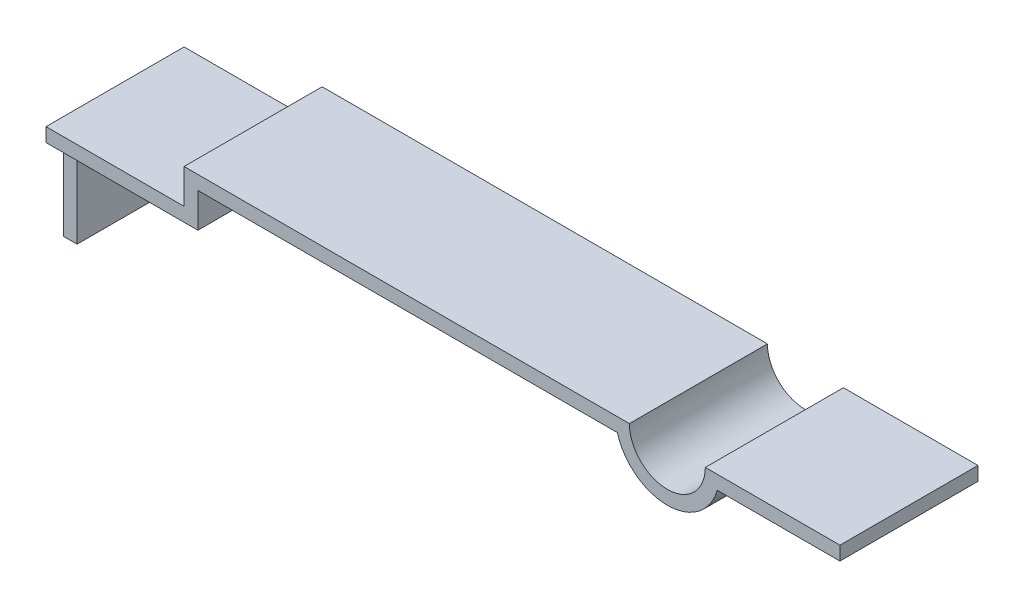
ISO-10303-21;
HEADER;
FILE_DESCRIPTION(('STEP AP214'),'2;1');
FILE_NAME('part.step','',(''),(''),'','','');
FILE_SCHEMA(('AUTOMOTIVE_DESIGN { 1 0 10303 214 1 1 1 1 }'));
ENDSEC;
DATA;
#1=APPLICATION_CONTEXT('core data for automotive mechanical design processes');
#2=APPLICATION_PROTOCOL_DEFINITION('international standard','automotive_design',2000,#1);
#3=PRODUCT_CONTEXT('',#1,'mechanical');
#4=PRODUCT('Part','Part','',(#3));
#5=PRODUCT_RELATED_PRODUCT_CATEGORY('part','',(#4));
#6=PRODUCT_DEFINITION_FORMATION('','',#4);
#7=PRODUCT_DEFINITION_CONTEXT('part definition',#1,'design');
#8=PRODUCT_DEFINITION('design','',#6,#7);
#9=PRODUCT_DEFINITION_SHAPE('','',#8);
#10=(LENGTH_UNIT() NAMED_UNIT(*) SI_UNIT(.MILLI.,.METRE.));
#11=(NAMED_UNIT(*) PLANE_ANGLE_UNIT() SI_UNIT($,.RADIAN.));
#12=(NAMED_UNIT(*) SI_UNIT($,.STERADIAN.) SOLID_ANGLE_UNIT());
#13=UNCERTAINTY_MEASURE_WITH_UNIT(LENGTH_MEASURE(1.E-05),#10,'distance_accuracy_value','');
#14=(GEOMETRIC_REPRESENTATION_CONTEXT(3) GLOBAL_UNCERTAINTY_ASSIGNED_CONTEXT((#13)) GLOBAL_UNIT_ASSIGNED_CONTEXT((#10,
#11,#12)) REPRESENTATION_CONTEXT('',''));
#15=CARTESIAN_POINT('',(0.,0.,0.));
#16=DIRECTION('',(0.,0.,1.));
#17=DIRECTION('',(1.,0.,0.));
#18=AXIS2_PLACEMENT_3D('',#15,#16,#17);
#19=CARTESIAN_POINT('',(0.,0.3,2.));
#20=DIRECTION('',(0.,1.,0.));
#21=DIRECTION('',(-1.,0.,0.));
#22=AXIS2_PLACEMENT_3D('',#19,#20,#21);
#23=PLANE('',#22);
#24=DIRECTION('',(1.,0.,0.));
#25=VECTOR('',#24,1.);
#26=CARTESIAN_POINT('',(0.,0.3,0.));
#27=LINE('',#26,#25);
#28=CARTESIAN_POINT('',(0.2,0.299999999999999,0.));
#29=VERTEX_POINT('',#28);
#30=CARTESIAN_POINT('',(6.27715838525995,0.299999999999978,0.));
#31=VERTEX_POINT('',#30);
#32=EDGE_CURVE('E168',#29,#31,#27,.T.);
#33=ORIENTED_EDGE('',*,*,#32,.T.);
#34=DIRECTION('',(0.,0.,-1.));
#35=VECTOR('',#34,1.);
#36=CARTESIAN_POINT('',(6.27715838525995,0.299999999999978,2.));
#37=LINE('',#36,#35);
#38=CARTESIAN_POINT('',(6.27715838525995,0.299999999999978,2.));
#39=VERTEX_POINT('',#38);
#40=EDGE_CURVE('E11',#39,#31,#37,.T.);
#41=ORIENTED_EDGE('',*,*,#40,.F.);
#42=DIRECTION('',(1.,0.,0.));
#43=VECTOR('',#42,1.);
#44=CARTESIAN_POINT('',(0.,0.3,2.));
#45=LINE('',#44,#43);
#46=CARTESIAN_POINT('',(0.2,0.299999999999999,2.));
#47=VERTEX_POINT('',#46);
#48=EDGE_CURVE('E197',#47,#39,#45,.T.);
#49=ORIENTED_EDGE('',*,*,#48,.F.);
#50=DIRECTION('',(0.,0.,-1.));
#51=VECTOR('',#50,1.);
#52=CARTESIAN_POINT('',(0.2,0.299999999999999,2.));
#53=LINE('',#52,#51);
#54=EDGE_CURVE('E167',#47,#29,#53,.T.);
#55=ORIENTED_EDGE('',*,*,#54,.T.);
#56=EDGE_LOOP('',(#33,#41,#49,#55));
#57=FACE_BOUND('',#56,.T.);
#58=ADVANCED_FACE('F35',(#57),#23,.F.);
#59=CARTESIAN_POINT('',(7.,0.499999999999976,2.));
#60=DIRECTION('',(0.,0.,-1.));
#61=DIRECTION('',(-1.,0.,0.));
#62=AXIS2_PLACEMENT_3D('',#59,#60,#61);
#63=CYLINDRICAL_SURFACE('',#62,0.75);
#64=CARTESIAN_POINT('',(7.,0.499999999999976,0.));
#65=DIRECTION('',(0.,0.,1.));
#66=DIRECTION('',(1.,0.,0.));
#67=AXIS2_PLACEMENT_3D('',#64,#65,#66);
#68=CIRCLE('',#67,0.75);
#69=CARTESIAN_POINT('',(7.72284161474005,0.299999999999973,0.));
#70=VERTEX_POINT('',#69);
#71=EDGE_CURVE('E171',#31,#70,#68,.T.);
#72=ORIENTED_EDGE('',*,*,#71,.T.);
#73=DIRECTION('',(0.,0.,-1.));
#74=VECTOR('',#73,1.);
#75=CARTESIAN_POINT('',(7.72284161474005,0.299999999999973,2.));
#76=LINE('',#75,#74);
#77=CARTESIAN_POINT('',(7.72284161474005,0.299999999999973,2.));
#78=VERTEX_POINT('',#77);
#79=EDGE_CURVE('E42',#78,#70,#76,.T.);
#80=ORIENTED_EDGE('',*,*,#79,.F.);
#81=CARTESIAN_POINT('',(7.,0.499999999999976,2.));
#82=DIRECTION('',(0.,0.,1.));
#83=DIRECTION('',(1.,0.,0.));
#84=AXIS2_PLACEMENT_3D('',#81,#82,#83);
#85=CIRCLE('',#84,0.75);
#86=EDGE_CURVE('E107',#39,#78,#85,.T.);
#87=ORIENTED_EDGE('',*,*,#86,.F.);
#88=ORIENTED_EDGE('',*,*,#40,.T.);
#89=EDGE_LOOP('',(#72,#80,#87,#88));
#90=FACE_BOUND('',#89,.T.);
#91=ADVANCED_FACE('F289',(#90),#63,.T.);
#92=CARTESIAN_POINT('',(0.,0.3,2.));
#93=DIRECTION('',(0.,1.,0.));
#94=DIRECTION('',(-1.,0.,0.));
#95=AXIS2_PLACEMENT_3D('',#92,#93,#94);
#96=PLANE('',#95);
#97=DIRECTION('',(1.,0.,0.));
#98=VECTOR('',#97,1.);
#99=CARTESIAN_POINT('',(0.,0.3,0.));
#100=LINE('',#99,#98);
#101=CARTESIAN_POINT('',(9.5,0.299999999999967,0.));
#102=VERTEX_POINT('',#101);
#103=EDGE_CURVE('E174',#70,#102,#100,.T.);
#104=ORIENTED_EDGE('',*,*,#103,.T.);
#105=DIRECTION('',(0.,0.,-1.));
#106=VECTOR('',#105,1.);
#107=CARTESIAN_POINT('',(9.5,0.299999999999967,2.));
#108=LINE('',#107,#106);
#109=CARTESIAN_POINT('',(9.5,0.299999999999967,2.));
#110=VERTEX_POINT('',#109);
#111=EDGE_CURVE('E218',#110,#102,#108,.T.);
#112=ORIENTED_EDGE('',*,*,#111,.F.);
#113=DIRECTION('',(1.,0.,0.));
#114=VECTOR('',#113,1.);
#115=CARTESIAN_POINT('',(0.,0.3,2.));
#116=LINE('',#115,#114);
#117=EDGE_CURVE('E225',#78,#110,#116,.T.);
#118=ORIENTED_EDGE('',*,*,#117,.F.);
#119=ORIENTED_EDGE('',*,*,#79,.T.);
#120=EDGE_LOOP('',(#104,#112,#118,#119));
#121=FACE_BOUND('',#120,.T.);
#122=ADVANCED_FACE('F223',(#121),#96,.F.);
#123=CARTESIAN_POINT('',(9.5,0.,2.));
#124=DIRECTION('',(1.,0.,0.));
#125=DIRECTION('',(0.,0.,-1.));
#126=AXIS2_PLACEMENT_3D('',#123,#124,#125);
#127=PLANE('',#126);
#128=DIRECTION('',(0.,-1.,0.));
#129=VECTOR('',#128,1.);
#130=CARTESIAN_POINT('',(9.5,0.,0.));
#131=LINE('',#130,#129);
#132=CARTESIAN_POINT('',(9.5,0.499999999999967,0.));
#133=VERTEX_POINT('',#132);
#134=EDGE_CURVE('E177',#133,#102,#131,.T.);
#135=ORIENTED_EDGE('',*,*,#134,.F.);
#136=DIRECTION('',(0.,0.,-1.));
#137=VECTOR('',#136,1.);
#138=CARTESIAN_POINT('',(9.5,0.499999999999967,2.));
#139=LINE('',#138,#137);
#140=CARTESIAN_POINT('',(9.5,0.499999999999967,2.));
#141=VERTEX_POINT('',#140);
#142=EDGE_CURVE('E216',#141,#133,#139,.T.);
#143=ORIENTED_EDGE('',*,*,#142,.F.);
#144=DIRECTION('',(0.,-1.,0.));
#145=VECTOR('',#144,1.);
#146=CARTESIAN_POINT('',(9.5,0.,2.));
#147=LINE('',#146,#145);
#148=EDGE_CURVE('E234',#141,#110,#147,.T.);
#149=ORIENTED_EDGE('',*,*,#148,.T.);
#150=ORIENTED_EDGE('',*,*,#111,.T.);
#151=EDGE_LOOP('',(#135,#143,#149,#150));
#152=FACE_BOUND('',#151,.T.);
#153=ADVANCED_FACE('F231',(#152),#127,.T.);
#154=CARTESIAN_POINT('',(0.,0.5,2.));
#155=DIRECTION('',(0.,1.,0.));
#156=DIRECTION('',(-1.,0.,0.));
#157=AXIS2_PLACEMENT_3D('',#154,#155,#156);
#158=PLANE('',#157);
#159=DIRECTION('',(1.,0.,0.));
#160=VECTOR('',#159,1.);
#161=CARTESIAN_POINT('',(0.,0.5,0.));
#162=LINE('',#161,#160);
#163=CARTESIAN_POINT('',(7.55,0.499999999999974,0.));
#164=VERTEX_POINT('',#163);
#165=EDGE_CURVE('E180',#164,#133,#162,.T.);
#166=ORIENTED_EDGE('',*,*,#165,.F.);
#167=DIRECTION('',(0.,0.,-1.));
#168=VECTOR('',#167,1.);
#169=CARTESIAN_POINT('',(7.55,0.499999999999974,2.));
#170=LINE('',#169,#168);
#171=CARTESIAN_POINT('',(7.55,0.499999999999974,2.));
#172=VERTEX_POINT('',#171);
#173=EDGE_CURVE('E214',#172,#164,#170,.T.);
#174=ORIENTED_EDGE('',*,*,#173,.F.);
#175=DIRECTION('',(1.,0.,0.));
#176=VECTOR('',#175,1.);
#177=CARTESIAN_POINT('',(0.,0.5,2.));
#178=LINE('',#177,#176);
#179=EDGE_CURVE('E237',#172,#141,#178,.T.);
#180=ORIENTED_EDGE('',*,*,#179,.T.);
#181=ORIENTED_EDGE('',*,*,#142,.T.);
#182=EDGE_LOOP('',(#166,#174,#180,#181));
#183=FACE_BOUND('',#182,.T.);
#184=ADVANCED_FACE('F299',(#183),#158,.T.);
#185=CARTESIAN_POINT('',(7.,0.499999999999976,2.));
#186=DIRECTION('',(0.,0.,-1.));
#187=DIRECTION('',(-1.,0.,0.));
#188=AXIS2_PLACEMENT_3D('',#185,#186,#187);
#189=CYLINDRICAL_SURFACE('',#188,0.55);
#190=CARTESIAN_POINT('',(7.,0.499999999999976,0.));
#191=DIRECTION('',(0.,0.,1.));
#192=DIRECTION('',(1.,0.,0.));
#193=AXIS2_PLACEMENT_3D('',#190,#191,#192);
#194=CIRCLE('',#193,0.55);
#195=CARTESIAN_POINT('',(6.45,0.499999999999978,0.));
#196=VERTEX_POINT('',#195);
#197=EDGE_CURVE('E183',#196,#164,#194,.T.);
#198=ORIENTED_EDGE('',*,*,#197,.F.);
#199=DIRECTION('',(0.,0.,-1.));
#200=VECTOR('',#199,1.);
#201=CARTESIAN_POINT('',(6.45,0.499999999999978,2.));
#202=LINE('',#201,#200);
#203=CARTESIAN_POINT('',(6.45,0.499999999999978,2.));
#204=VERTEX_POINT('',#203);
#205=EDGE_CURVE('E212',#204,#196,#202,.T.);
#206=ORIENTED_EDGE('',*,*,#205,.F.);
#207=CARTESIAN_POINT('',(7.,0.499999999999976,2.));
#208=DIRECTION('',(0.,0.,1.));
#209=DIRECTION('',(1.,0.,0.));
#210=AXIS2_PLACEMENT_3D('',#207,#208,#209);
#211=CIRCLE('',#210,0.55);
#212=EDGE_CURVE('E239',#204,#172,#211,.T.);
#213=ORIENTED_EDGE('',*,*,#212,.T.);
#214=ORIENTED_EDGE('',*,*,#173,.T.);
#215=EDGE_LOOP('',(#198,#206,#213,#214));
#216=FACE_BOUND('',#215,.T.);
#217=ADVANCED_FACE('F302',(#216),#189,.F.);
#218=CARTESIAN_POINT('',(0.,0.5,2.));
#219=DIRECTION('',(0.,1.,0.));
#220=DIRECTION('',(-1.,0.,0.));
#221=AXIS2_PLACEMENT_3D('',#218,#219,#220);
#222=PLANE('',#221);
#223=DIRECTION('',(1.,0.,0.));
#224=VECTOR('',#223,1.);
#225=CARTESIAN_POINT('',(0.,0.5,0.));
#226=LINE('',#225,#224);
#227=CARTESIAN_POINT('',(0.,0.5,0.));
#228=VERTEX_POINT('',#227);
#229=EDGE_CURVE('E186',#228,#196,#226,.T.);
#230=ORIENTED_EDGE('',*,*,#229,.F.);
#231=DIRECTION('',(0.,0.,-1.));
#232=VECTOR('',#231,1.);
#233=CARTESIAN_POINT('',(0.,0.5,2.));
#234=LINE('',#233,#232);
#235=CARTESIAN_POINT('',(0.,0.5,2.));
#236=VERTEX_POINT('',#235);
#237=EDGE_CURVE('E210',#236,#228,#234,.T.);
#238=ORIENTED_EDGE('',*,*,#237,.F.);
#239=DIRECTION('',(1.,0.,0.));
#240=VECTOR('',#239,1.);
#241=CARTESIAN_POINT('',(0.,0.5,2.));
#242=LINE('',#241,#240);
#243=EDGE_CURVE('E246',#236,#204,#242,.T.);
#244=ORIENTED_EDGE('',*,*,#243,.T.);
#245=ORIENTED_EDGE('',*,*,#205,.T.);
#246=EDGE_LOOP('',(#230,#238,#244,#245));
#247=FACE_BOUND('',#246,.T.);
#248=ADVANCED_FACE('F306',(#247),#222,.T.);
#249=CARTESIAN_POINT('',(0.,0.,2.));
#250=DIRECTION('',(-1.,0.,0.));
#251=DIRECTION('',(0.,0.,1.));
#252=AXIS2_PLACEMENT_3D('',#249,#250,#251);
#253=PLANE('',#252);
#254=DIRECTION('',(0.,1.,0.));
#255=VECTOR('',#254,1.);
#256=CARTESIAN_POINT('',(0.,0.,0.));
#257=LINE('',#256,#255);
#258=CARTESIAN_POINT('',(0.,0.,0.));
#259=VERTEX_POINT('',#258);
#260=EDGE_CURVE('E189',#259,#228,#257,.T.);
#261=ORIENTED_EDGE('',*,*,#260,.F.);
#262=DIRECTION('',(0.,0.,-1.));
#263=VECTOR('',#262,1.);
#264=CARTESIAN_POINT('',(0.,0.,2.));
#265=LINE('',#264,#263);
#266=CARTESIAN_POINT('',(0.,0.,2.));
#267=VERTEX_POINT('',#266);
#268=EDGE_CURVE('E151',#267,#259,#265,.T.);
#269=ORIENTED_EDGE('',*,*,#268,.F.);
#270=DIRECTION('',(0.,1.,0.));
#271=VECTOR('',#270,1.);
#272=CARTESIAN_POINT('',(0.,0.,2.));
#273=LINE('',#272,#271);
#274=EDGE_CURVE('E141',#267,#236,#273,.T.);
#275=ORIENTED_EDGE('',*,*,#274,.T.);
#276=ORIENTED_EDGE('',*,*,#237,.T.);
#277=EDGE_LOOP('',(#261,#269,#275,#276));
#278=FACE_BOUND('',#277,.T.);
#279=ADVANCED_FACE('F250',(#278),#253,.T.);
#280=CARTESIAN_POINT('',(0.,0.,2.));
#281=DIRECTION('',(0.,-1.,0.));
#282=DIRECTION('',(1.,0.,0.));
#283=AXIS2_PLACEMENT_3D('',#280,#281,#282);
#284=PLANE('',#283);
#285=DIRECTION('',(-1.,0.,0.));
#286=VECTOR('',#285,1.);
#287=CARTESIAN_POINT('',(0.,0.,0.));
#288=LINE('',#287,#286);
#289=CARTESIAN_POINT('',(-2.,0.,0.));
#290=VERTEX_POINT('',#289);
#291=EDGE_CURVE('E148',#259,#290,#288,.T.);
#292=ORIENTED_EDGE('',*,*,#291,.T.);
#293=DIRECTION('',(0.,0.,-1.));
#294=VECTOR('',#293,1.);
#295=CARTESIAN_POINT('',(-2.,0.,2.));
#296=LINE('',#295,#294);
#297=CARTESIAN_POINT('',(-2.,0.,2.));
#298=VERTEX_POINT('',#297);
#299=EDGE_CURVE('E145',#298,#290,#296,.T.);
#300=ORIENTED_EDGE('',*,*,#299,.F.);
#301=DIRECTION('',(-1.,0.,0.));
#302=VECTOR('',#301,1.);
#303=CARTESIAN_POINT('',(0.,0.,2.));
#304=LINE('',#303,#302);
#305=EDGE_CURVE('E134',#267,#298,#304,.T.);
#306=ORIENTED_EDGE('',*,*,#305,.F.);
#307=ORIENTED_EDGE('',*,*,#268,.T.);
#308=EDGE_LOOP('',(#292,#300,#306,#307));
#309=FACE_BOUND('',#308,.T.);
#310=ADVANCED_FACE('F146',(#309),#284,.F.);
#311=CARTESIAN_POINT('',(-2.,0.,2.));
#312=DIRECTION('',(1.,0.,0.));
#313=DIRECTION('',(0.,1.,0.));
#314=AXIS2_PLACEMENT_3D('',#311,#312,#313);
#315=PLANE('',#314);
#316=DIRECTION('',(0.,0.,1.));
#317=VECTOR('',#316,1.);
#318=CARTESIAN_POINT('',(-2.,-0.2,0.));
#319=LINE('',#318,#317);
#320=CARTESIAN_POINT('',(-2.,-0.2,0.));
#321=VERTEX_POINT('',#320);
#322=CARTESIAN_POINT('',(-2.,-0.2,0.25));
#323=VERTEX_POINT('',#322);
#324=EDGE_CURVE('E254',#321,#323,#319,.T.);
#325=ORIENTED_EDGE('',*,*,#324,.T.);
#326=DIRECTION('',(0.,-1.,0.));
#327=VECTOR('',#326,1.);
#328=CARTESIAN_POINT('',(-2.,-1.5,0.25));
#329=LINE('',#328,#327);
#330=CARTESIAN_POINT('',(-2.,-1.5,0.25));
#331=VERTEX_POINT('',#330);
#332=EDGE_CURVE('E258',#323,#331,#329,.T.);
#333=ORIENTED_EDGE('',*,*,#332,.T.);
#334=DIRECTION('',(0.,0.,-1.));
#335=VECTOR('',#334,1.);
#336=CARTESIAN_POINT('',(-2.,-1.5,2.));
#337=LINE('',#336,#335);
#338=CARTESIAN_POINT('',(-2.,-1.5,1.75));
#339=VERTEX_POINT('',#338);
#340=EDGE_CURVE('E152',#339,#331,#337,.T.);
#341=ORIENTED_EDGE('',*,*,#340,.F.);
#342=DIRECTION('',(0.,1.,0.));
#343=VECTOR('',#342,1.);
#344=CARTESIAN_POINT('',(-2.,-1.5,1.75));
#345=LINE('',#344,#343);
#346=CARTESIAN_POINT('',(-2.,-0.2,1.75));
#347=VERTEX_POINT('',#346);
#348=EDGE_CURVE('E276',#339,#347,#345,.T.);
#349=ORIENTED_EDGE('',*,*,#348,.T.);
#350=DIRECTION('',(0.,0.,1.));
#351=VECTOR('',#350,1.);
#352=CARTESIAN_POINT('',(-2.,-0.2,2.));
#353=LINE('',#352,#351);
#354=CARTESIAN_POINT('',(-2.,-0.2,2.));
#355=VERTEX_POINT('',#354);
#356=EDGE_CURVE('E159',#347,#355,#353,.T.);
#357=ORIENTED_EDGE('',*,*,#356,.T.);
#358=DIRECTION('',(0.,-1.,0.));
#359=VECTOR('',#358,1.);
#360=CARTESIAN_POINT('',(-2.,0.,2.));
#361=LINE('',#360,#359);
#362=EDGE_CURVE('E138',#298,#355,#361,.T.);
#363=ORIENTED_EDGE('',*,*,#362,.F.);
#364=ORIENTED_EDGE('',*,*,#299,.T.);
#365=DIRECTION('',(0.,-1.,0.));
#366=VECTOR('',#365,1.);
#367=CARTESIAN_POINT('',(-2.,0.,0.));
#368=LINE('',#367,#366);
#369=EDGE_CURVE('E193',#290,#321,#368,.T.);
#370=ORIENTED_EDGE('',*,*,#369,.T.);
#371=EDGE_LOOP('',(#325,#333,#341,#349,#357,#363,#364,#370));
#372=FACE_BOUND('',#371,.T.);
#373=ADVANCED_FACE('F156',(#372),#315,.F.);
#374=CARTESIAN_POINT('',(0.,-1.5,2.));
#375=DIRECTION('',(0.,1.,0.));
#376=DIRECTION('',(0.,0.,1.));
#377=AXIS2_PLACEMENT_3D('',#374,#375,#376);
#378=PLANE('',#377);
#379=ORIENTED_EDGE('',*,*,#340,.T.);
#380=DIRECTION('',(1.,0.,0.));
#381=VECTOR('',#380,1.);
#382=CARTESIAN_POINT('',(-2.,-1.5,0.25));
#383=LINE('',#382,#381);
#384=CARTESIAN_POINT('',(-1.8,-1.5,0.25));
#385=VERTEX_POINT('',#384);
#386=EDGE_CURVE('E270',#331,#385,#383,.T.);
#387=ORIENTED_EDGE('',*,*,#386,.T.);
#388=DIRECTION('',(0.,0.,-1.));
#389=VECTOR('',#388,1.);
#390=CARTESIAN_POINT('',(-1.8,-1.5,2.));
#391=LINE('',#390,#389);
#392=CARTESIAN_POINT('',(-1.8,-1.5,1.75));
#393=VERTEX_POINT('',#392);
#394=EDGE_CURVE('E204',#393,#385,#391,.T.);
#395=ORIENTED_EDGE('',*,*,#394,.F.);
#396=DIRECTION('',(1.,0.,0.));
#397=VECTOR('',#396,1.);
#398=CARTESIAN_POINT('',(-2.,-1.5,1.75));
#399=LINE('',#398,#397);
#400=EDGE_CURVE('E279',#339,#393,#399,.T.);
#401=ORIENTED_EDGE('',*,*,#400,.F.);
#402=EDGE_LOOP('',(#379,#387,#395,#401));
#403=FACE_BOUND('',#402,.T.);
#404=ADVANCED_FACE('F317',(#403),#378,.F.);
#405=CARTESIAN_POINT('',(-1.8,0.,2.));
#406=DIRECTION('',(1.,0.,0.));
#407=DIRECTION('',(0.,0.,-1.));
#408=AXIS2_PLACEMENT_3D('',#405,#406,#407);
#409=PLANE('',#408);
#410=DIRECTION('',(0.,-1.,0.));
#411=VECTOR('',#410,1.);
#412=CARTESIAN_POINT('',(-1.8,-1.5,0.25));
#413=LINE('',#412,#411);
#414=CARTESIAN_POINT('',(-1.8,-0.2,0.25));
#415=VERTEX_POINT('',#414);
#416=EDGE_CURVE('E263',#415,#385,#413,.T.);
#417=ORIENTED_EDGE('',*,*,#416,.F.);
#418=DIRECTION('',(0.,0.,-1.));
#419=VECTOR('',#418,1.);
#420=CARTESIAN_POINT('',(-1.8,-0.2,2.));
#421=LINE('',#420,#419);
#422=CARTESIAN_POINT('',(-1.8,-0.2,1.75));
#423=VERTEX_POINT('',#422);
#424=EDGE_CURVE('E201',#423,#415,#421,.T.);
#425=ORIENTED_EDGE('',*,*,#424,.F.);
#426=DIRECTION('',(0.,1.,0.));
#427=VECTOR('',#426,1.);
#428=CARTESIAN_POINT('',(-1.8,-1.5,1.75));
#429=LINE('',#428,#427);
#430=EDGE_CURVE('E273',#393,#423,#429,.T.);
#431=ORIENTED_EDGE('',*,*,#430,.F.);
#432=ORIENTED_EDGE('',*,*,#394,.T.);
#433=EDGE_LOOP('',(#417,#425,#431,#432));
#434=FACE_BOUND('',#433,.T.);
#435=ADVANCED_FACE('F320',(#434),#409,.T.);
#436=CARTESIAN_POINT('',(0.,-0.2,2.));
#437=DIRECTION('',(0.,-1.,0.));
#438=DIRECTION('',(1.,0.,0.));
#439=AXIS2_PLACEMENT_3D('',#436,#437,#438);
#440=PLANE('',#439);
#441=DIRECTION('',(-1.,0.,0.));
#442=VECTOR('',#441,1.);
#443=CARTESIAN_POINT('',(0.,-0.2,0.));
#444=LINE('',#443,#442);
#445=CARTESIAN_POINT('',(0.2,-0.2,0.));
#446=VERTEX_POINT('',#445);
#447=EDGE_CURVE('E49',#446,#321,#444,.T.);
#448=ORIENTED_EDGE('',*,*,#447,.F.);
#449=DIRECTION('',(0.,0.,-1.));
#450=VECTOR('',#449,1.);
#451=CARTESIAN_POINT('',(0.2,-0.2,2.));
#452=LINE('',#451,#450);
#453=CARTESIAN_POINT('',(0.2,-0.2,2.));
#454=VERTEX_POINT('',#453);
#455=EDGE_CURVE('E199',#454,#446,#452,.T.);
#456=ORIENTED_EDGE('',*,*,#455,.F.);
#457=DIRECTION('',(-1.,0.,0.));
#458=VECTOR('',#457,1.);
#459=CARTESIAN_POINT('',(0.,-0.2,2.));
#460=LINE('',#459,#458);
#461=EDGE_CURVE('E160',#454,#355,#460,.T.);
#462=ORIENTED_EDGE('',*,*,#461,.T.);
#463=ORIENTED_EDGE('',*,*,#356,.F.);
#464=DIRECTION('',(1.,0.,0.));
#465=VECTOR('',#464,1.);
#466=CARTESIAN_POINT('',(-2.,-0.2,1.75));
#467=LINE('',#466,#465);
#468=EDGE_CURVE('E172',#347,#423,#467,.T.);
#469=ORIENTED_EDGE('',*,*,#468,.T.);
#470=ORIENTED_EDGE('',*,*,#424,.T.);
#471=DIRECTION('',(1.,0.,0.));
#472=VECTOR('',#471,1.);
#473=CARTESIAN_POINT('',(-2.,-0.2,0.25));
#474=LINE('',#473,#472);
#475=EDGE_CURVE('E265',#323,#415,#474,.T.);
#476=ORIENTED_EDGE('',*,*,#475,.F.);
#477=ORIENTED_EDGE('',*,*,#324,.F.);
#478=EDGE_LOOP('',(#448,#456,#462,#463,#469,#470,#476,#477));
#479=FACE_BOUND('',#478,.T.);
#480=ADVANCED_FACE('F324',(#479),#440,.T.);
#481=CARTESIAN_POINT('',(0.2,0.,2.));
#482=DIRECTION('',(-1.,0.,0.));
#483=DIRECTION('',(0.,0.,1.));
#484=AXIS2_PLACEMENT_3D('',#481,#482,#483);
#485=PLANE('',#484);
#486=DIRECTION('',(0.,1.,0.));
#487=VECTOR('',#486,1.);
#488=CARTESIAN_POINT('',(0.2,0.,0.));
#489=LINE('',#488,#487);
#490=EDGE_CURVE('E99',#446,#29,#489,.T.);
#491=ORIENTED_EDGE('',*,*,#490,.T.);
#492=ORIENTED_EDGE('',*,*,#54,.F.);
#493=DIRECTION('',(0.,1.,0.));
#494=VECTOR('',#493,1.);
#495=CARTESIAN_POINT('',(0.2,0.,2.));
#496=LINE('',#495,#494);
#497=EDGE_CURVE('E58',#454,#47,#496,.T.);
#498=ORIENTED_EDGE('',*,*,#497,.F.);
#499=ORIENTED_EDGE('',*,*,#455,.T.);
#500=EDGE_LOOP('',(#491,#492,#498,#499));
#501=FACE_BOUND('',#500,.T.);
#502=ADVANCED_FACE('F328',(#501),#485,.F.);
#503=CARTESIAN_POINT('',(0.,0.,2.));
#504=DIRECTION('',(0.,0.,1.));
#505=DIRECTION('',(1.,0.,0.));
#506=AXIS2_PLACEMENT_3D('',#503,#504,#505);
#507=PLANE('',#506);
#508=ORIENTED_EDGE('',*,*,#362,.T.);
#509=ORIENTED_EDGE('',*,*,#461,.F.);
#510=ORIENTED_EDGE('',*,*,#497,.T.);
#511=ORIENTED_EDGE('',*,*,#48,.T.);
#512=ORIENTED_EDGE('',*,*,#86,.T.);
#513=ORIENTED_EDGE('',*,*,#117,.T.);
#514=ORIENTED_EDGE('',*,*,#148,.F.);
#515=ORIENTED_EDGE('',*,*,#179,.F.);
#516=ORIENTED_EDGE('',*,*,#212,.F.);
#517=ORIENTED_EDGE('',*,*,#243,.F.);
#518=ORIENTED_EDGE('',*,*,#274,.F.);
#519=ORIENTED_EDGE('',*,*,#305,.T.);
#520=EDGE_LOOP('',(#508,#509,#510,#511,#512,#513,#514,#515,#516,#517,#518,#519));
#521=FACE_BOUND('',#520,.T.);
#522=ADVANCED_FACE('F136',(#521),#507,.T.);
#523=CARTESIAN_POINT('',(0.,0.,0.));
#524=DIRECTION('',(0.,0.,1.));
#525=DIRECTION('',(1.,0.,0.));
#526=AXIS2_PLACEMENT_3D('',#523,#524,#525);
#527=PLANE('',#526);
#528=ORIENTED_EDGE('',*,*,#447,.T.);
#529=ORIENTED_EDGE('',*,*,#369,.F.);
#530=ORIENTED_EDGE('',*,*,#291,.F.);
#531=ORIENTED_EDGE('',*,*,#260,.T.);
#532=ORIENTED_EDGE('',*,*,#229,.T.);
#533=ORIENTED_EDGE('',*,*,#197,.T.);
#534=ORIENTED_EDGE('',*,*,#165,.T.);
#535=ORIENTED_EDGE('',*,*,#134,.T.);
#536=ORIENTED_EDGE('',*,*,#103,.F.);
#537=ORIENTED_EDGE('',*,*,#71,.F.);
#538=ORIENTED_EDGE('',*,*,#32,.F.);
#539=ORIENTED_EDGE('',*,*,#490,.F.);
#540=EDGE_LOOP('',(#528,#529,#530,#531,#532,#533,#534,#535,#536,#537,#538,#539));
#541=FACE_BOUND('',#540,.T.);
#542=ADVANCED_FACE('F226',(#541),#527,.F.);
#543=CARTESIAN_POINT('',(-2.,-1.5,1.75));
#544=DIRECTION('',(0.,0.,-1.));
#545=DIRECTION('',(-1.,0.,0.));
#546=AXIS2_PLACEMENT_3D('',#543,#544,#545);
#547=PLANE('',#546);
#548=ORIENTED_EDGE('',*,*,#430,.T.);
#549=ORIENTED_EDGE('',*,*,#468,.F.);
#550=ORIENTED_EDGE('',*,*,#348,.F.);
#551=ORIENTED_EDGE('',*,*,#400,.T.);
#552=EDGE_LOOP('',(#548,#549,#550,#551));
#553=FACE_BOUND('',#552,.T.);
#554=ADVANCED_FACE('F333',(#553),#547,.F.);
#555=CARTESIAN_POINT('',(-2.,-1.5,0.25));
#556=DIRECTION('',(0.,0.,1.));
#557=DIRECTION('',(1.,0.,0.));
#558=AXIS2_PLACEMENT_3D('',#555,#556,#557);
#559=PLANE('',#558);
#560=ORIENTED_EDGE('',*,*,#416,.T.);
#561=ORIENTED_EDGE('',*,*,#386,.F.);
#562=ORIENTED_EDGE('',*,*,#332,.F.);
#563=ORIENTED_EDGE('',*,*,#475,.T.);
#564=EDGE_LOOP('',(#560,#561,#562,#563));
#565=FACE_BOUND('',#564,.T.);
#566=ADVANCED_FACE('F338',(#565),#559,.F.);
#567=CLOSED_SHELL('',(#58,#91,#122,#153,#184,#217,#248,#279,#310,#373,#404,#435,#480,#502,#522,
#542,#554,#566));
#568=MANIFOLD_SOLID_BREP('B2',#567);
#569=ADVANCED_BREP_SHAPE_REPRESENTATION('',(#18,#568),#14);
#570=SHAPE_DEFINITION_REPRESENTATION(#9,#569);
ENDSEC;
END-ISO-10303-21;
